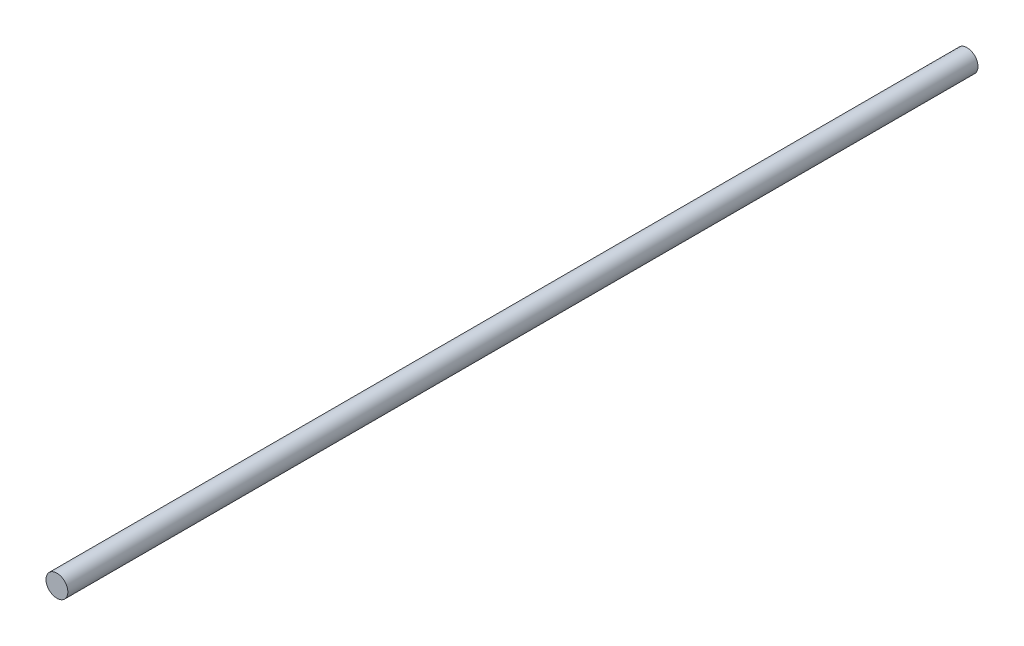
ISO-10303-21;
HEADER;
FILE_DESCRIPTION(('STEP AP214'),'2;1');
FILE_NAME('part.step','',(''),(''),'','','');
FILE_SCHEMA(('AUTOMOTIVE_DESIGN { 1 0 10303 214 1 1 1 1 }'));
ENDSEC;
DATA;
#1=APPLICATION_CONTEXT('core data for automotive mechanical design processes');
#2=APPLICATION_PROTOCOL_DEFINITION('international standard','automotive_design',2000,#1);
#3=PRODUCT_CONTEXT('',#1,'mechanical');
#4=PRODUCT('Part','Part','',(#3));
#5=PRODUCT_RELATED_PRODUCT_CATEGORY('part','',(#4));
#6=PRODUCT_DEFINITION_FORMATION('','',#4);
#7=PRODUCT_DEFINITION_CONTEXT('part definition',#1,'design');
#8=PRODUCT_DEFINITION('design','',#6,#7);
#9=PRODUCT_DEFINITION_SHAPE('','',#8);
#10=(LENGTH_UNIT() NAMED_UNIT(*) SI_UNIT(.MILLI.,.METRE.));
#11=(NAMED_UNIT(*) PLANE_ANGLE_UNIT() SI_UNIT($,.RADIAN.));
#12=(NAMED_UNIT(*) SI_UNIT($,.STERADIAN.) SOLID_ANGLE_UNIT());
#13=UNCERTAINTY_MEASURE_WITH_UNIT(LENGTH_MEASURE(1.E-05),#10,'distance_accuracy_value','');
#14=(GEOMETRIC_REPRESENTATION_CONTEXT(3) GLOBAL_UNCERTAINTY_ASSIGNED_CONTEXT((#13)) GLOBAL_UNIT_ASSIGNED_CONTEXT((#10,
#11,#12)) REPRESENTATION_CONTEXT('',''));
#15=CARTESIAN_POINT('',(0.,0.,0.));
#16=DIRECTION('',(0.,0.,1.));
#17=DIRECTION('',(1.,0.,0.));
#18=AXIS2_PLACEMENT_3D('',#15,#16,#17);
#19=CARTESIAN_POINT('',(0.,0.,250.));
#20=DIRECTION('',(0.,0.,-1.));
#21=DIRECTION('',(-1.,0.,0.));
#22=AXIS2_PLACEMENT_3D('',#19,#20,#21);
#23=CYLINDRICAL_SURFACE('',#22,3.);
#24=CARTESIAN_POINT('',(0.,0.,250.));
#25=DIRECTION('',(0.,0.,1.));
#26=DIRECTION('',(1.,0.,0.));
#27=AXIS2_PLACEMENT_3D('',#24,#25,#26);
#28=CIRCLE('',#27,3.);
#29=CARTESIAN_POINT('',(3.,0.,250.));
#30=VERTEX_POINT('',#29);
#31=EDGE_CURVE('E10',#30,#30,#28,.T.);
#32=ORIENTED_EDGE('',*,*,#31,.F.);
#33=EDGE_LOOP('',(#32));
#34=FACE_BOUND('',#33,.T.);
#35=CARTESIAN_POINT('',(0.,0.,0.));
#36=DIRECTION('',(0.,0.,1.));
#37=DIRECTION('',(1.,0.,0.));
#38=AXIS2_PLACEMENT_3D('',#35,#36,#37);
#39=CIRCLE('',#38,3.);
#40=CARTESIAN_POINT('',(3.,0.,0.));
#41=VERTEX_POINT('',#40);
#42=EDGE_CURVE('E34',#41,#41,#39,.T.);
#43=ORIENTED_EDGE('',*,*,#42,.T.);
#44=EDGE_LOOP('',(#43));
#45=FACE_BOUND('',#44,.T.);
#46=ADVANCED_FACE('F31',(#34,#45),#23,.T.);
#47=CARTESIAN_POINT('',(0.,0.,250.));
#48=DIRECTION('',(0.,0.,1.));
#49=DIRECTION('',(1.,0.,0.));
#50=AXIS2_PLACEMENT_3D('',#47,#48,#49);
#51=PLANE('',#50);
#52=ORIENTED_EDGE('',*,*,#31,.T.);
#53=EDGE_LOOP('',(#52));
#54=FACE_BOUND('',#53,.T.);
#55=ADVANCED_FACE('F46',(#54),#51,.T.);
#56=CARTESIAN_POINT('',(0.,0.,0.));
#57=DIRECTION('',(0.,0.,1.));
#58=DIRECTION('',(1.,0.,0.));
#59=AXIS2_PLACEMENT_3D('',#56,#57,#58);
#60=PLANE('',#59);
#61=ORIENTED_EDGE('',*,*,#42,.F.);
#62=EDGE_LOOP('',(#61));
#63=FACE_BOUND('',#62,.T.);
#64=ADVANCED_FACE('F44',(#63),#60,.F.);
#65=CLOSED_SHELL('',(#46,#55,#64));
#66=MANIFOLD_SOLID_BREP('B2',#65);
#67=ADVANCED_BREP_SHAPE_REPRESENTATION('',(#18,#66),#14);
#68=SHAPE_DEFINITION_REPRESENTATION(#9,#67);
ENDSEC;
END-ISO-10303-21;
